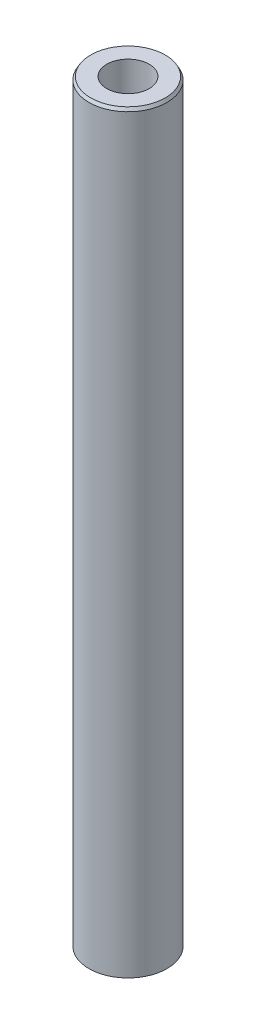
ISO-10303-21;
HEADER;
FILE_DESCRIPTION(('STEP AP214'),'2;1');
FILE_NAME('part.step','',(''),(''),'','','');
FILE_SCHEMA(('AUTOMOTIVE_DESIGN { 1 0 10303 214 1 1 1 1 }'));
ENDSEC;
DATA;
#1=APPLICATION_CONTEXT('core data for automotive mechanical design processes');
#2=APPLICATION_PROTOCOL_DEFINITION('international standard','automotive_design',2000,#1);
#3=PRODUCT_CONTEXT('',#1,'mechanical');
#4=PRODUCT('Part','Part','',(#3));
#5=PRODUCT_RELATED_PRODUCT_CATEGORY('part','',(#4));
#6=PRODUCT_DEFINITION_FORMATION('','',#4);
#7=PRODUCT_DEFINITION_CONTEXT('part definition',#1,'design');
#8=PRODUCT_DEFINITION('design','',#6,#7);
#9=PRODUCT_DEFINITION_SHAPE('','',#8);
#10=(LENGTH_UNIT() NAMED_UNIT(*) SI_UNIT(.MILLI.,.METRE.));
#11=(NAMED_UNIT(*) PLANE_ANGLE_UNIT() SI_UNIT($,.RADIAN.));
#12=(NAMED_UNIT(*) SI_UNIT($,.STERADIAN.) SOLID_ANGLE_UNIT());
#13=UNCERTAINTY_MEASURE_WITH_UNIT(LENGTH_MEASURE(1.E-05),#10,'distance_accuracy_value','');
#14=(GEOMETRIC_REPRESENTATION_CONTEXT(3) GLOBAL_UNCERTAINTY_ASSIGNED_CONTEXT((#13)) GLOBAL_UNIT_ASSIGNED_CONTEXT((#10,
#11,#12)) REPRESENTATION_CONTEXT('',''));
#15=CARTESIAN_POINT('',(0.,0.,0.));
#16=DIRECTION('',(0.,0.,1.));
#17=DIRECTION('',(1.,0.,0.));
#18=AXIS2_PLACEMENT_3D('',#15,#16,#17);
#19=CARTESIAN_POINT('',(0.,241.917062888604,0.));
#20=DIRECTION('',(0.,-1.,0.));
#21=DIRECTION('',(0.,0.,-1.));
#22=AXIS2_PLACEMENT_3D('',#19,#20,#21);
#23=CYLINDRICAL_SURFACE('',#22,12.5);
#24=CARTESIAN_POINT('',(0.,240.937329689685,0.));
#25=DIRECTION('',(0.,1.,0.));
#26=DIRECTION('',(0.,0.,1.));
#27=AXIS2_PLACEMENT_3D('',#24,#25,#26);
#28=CIRCLE('',#27,12.5);
#29=CARTESIAN_POINT('',(0.,240.937329689685,12.5));
#30=VERTEX_POINT('',#29);
#31=EDGE_CURVE('E50',#30,#30,#28,.F.);
#32=ORIENTED_EDGE('',*,*,#31,.T.);
#33=EDGE_LOOP('',(#32));
#34=FACE_BOUND('',#33,.T.);
#35=CARTESIAN_POINT('',(0.,0.565649226129838,0.));
#36=DIRECTION('',(0.,1.,0.));
#37=DIRECTION('',(0.,0.,1.));
#38=AXIS2_PLACEMENT_3D('',#35,#36,#37);
#39=CIRCLE('',#38,12.5);
#40=CARTESIAN_POINT('',(0.,0.565649226129838,12.5));
#41=VERTEX_POINT('',#40);
#42=EDGE_CURVE('E51',#41,#41,#39,.T.);
#43=ORIENTED_EDGE('',*,*,#42,.T.);
#44=EDGE_LOOP('',(#43));
#45=FACE_BOUND('',#44,.T.);
#46=ADVANCED_FACE('F39',(#34,#45),#23,.T.);
#47=CARTESIAN_POINT('',(0.,241.917062888604,0.));
#48=DIRECTION('',(0.,1.,0.));
#49=DIRECTION('',(0.,0.,1.));
#50=AXIS2_PLACEMENT_3D('',#47,#48,#49);
#51=PLANE('',#50);
#52=CARTESIAN_POINT('',(0.,241.917062888604,0.));
#53=DIRECTION('',(0.,1.,0.));
#54=DIRECTION('',(0.,0.,1.));
#55=AXIS2_PLACEMENT_3D('',#52,#53,#54);
#56=CIRCLE('',#55,11.9343507738702);
#57=CARTESIAN_POINT('',(0.,241.917062888604,11.9343507738702));
#58=VERTEX_POINT('',#57);
#59=EDGE_CURVE('E54',#58,#58,#56,.T.);
#60=ORIENTED_EDGE('',*,*,#59,.T.);
#61=EDGE_LOOP('',(#60));
#62=FACE_BOUND('',#61,.T.);
#63=CARTESIAN_POINT('',(0.,241.917062888604,0.));
#64=DIRECTION('',(0.,1.,0.));
#65=DIRECTION('',(0.,0.,1.));
#66=AXIS2_PLACEMENT_3D('',#63,#64,#65);
#67=CIRCLE('',#66,6.79041014084931);
#68=CARTESIAN_POINT('',(0.,241.917062888604,6.79041014084931));
#69=VERTEX_POINT('',#68);
#70=EDGE_CURVE('E58',#69,#69,#67,.T.);
#71=ORIENTED_EDGE('',*,*,#70,.F.);
#72=EDGE_LOOP('',(#71));
#73=FACE_BOUND('',#72,.T.);
#74=ADVANCED_FACE('F69',(#62,#73),#51,.T.);
#75=CARTESIAN_POINT('',(0.,0.,0.));
#76=DIRECTION('',(0.,1.,0.));
#77=DIRECTION('',(0.,0.,1.));
#78=AXIS2_PLACEMENT_3D('',#75,#76,#77);
#79=PLANE('',#78);
#80=CARTESIAN_POINT('',(0.,0.,0.));
#81=DIRECTION('',(0.,1.,0.));
#82=DIRECTION('',(0.,0.,1.));
#83=AXIS2_PLACEMENT_3D('',#80,#81,#82);
#84=CIRCLE('',#83,11.5202668010811);
#85=CARTESIAN_POINT('',(0.,0.,11.5202668010811));
#86=VERTEX_POINT('',#85);
#87=EDGE_CURVE('E10',#86,#86,#84,.F.);
#88=ORIENTED_EDGE('',*,*,#87,.T.);
#89=EDGE_LOOP('',(#88));
#90=FACE_BOUND('',#89,.T.);
#91=CARTESIAN_POINT('',(0.,0.,0.));
#92=DIRECTION('',(0.,1.,0.));
#93=DIRECTION('',(0.,0.,1.));
#94=AXIS2_PLACEMENT_3D('',#91,#92,#93);
#95=CIRCLE('',#94,6.79041014084931);
#96=CARTESIAN_POINT('',(0.,0.,6.79041014084931));
#97=VERTEX_POINT('',#96);
#98=EDGE_CURVE('E63',#97,#97,#95,.T.);
#99=ORIENTED_EDGE('',*,*,#98,.T.);
#100=EDGE_LOOP('',(#99));
#101=FACE_BOUND('',#100,.T.);
#102=ADVANCED_FACE('F75',(#90,#101),#79,.F.);
#103=CARTESIAN_POINT('',(0.,241.917062888604,0.));
#104=DIRECTION('',(0.,-1.,0.));
#105=DIRECTION('',(0.,0.,-1.));
#106=AXIS2_PLACEMENT_3D('',#103,#104,#105);
#107=CYLINDRICAL_SURFACE('',#106,6.79041014084931);
#108=ORIENTED_EDGE('',*,*,#70,.T.);
#109=EDGE_LOOP('',(#108));
#110=FACE_BOUND('',#109,.T.);
#111=ORIENTED_EDGE('',*,*,#98,.F.);
#112=EDGE_LOOP('',(#111));
#113=FACE_BOUND('',#112,.T.);
#114=ADVANCED_FACE('F70',(#110,#113),#107,.F.);
#115=CARTESIAN_POINT('',(0.,241.917062888604,0.));
#116=DIRECTION('',(0.,-1.,0.));
#117=DIRECTION('',(0.,0.,-1.));
#118=AXIS2_PLACEMENT_3D('',#115,#116,#117);
#119=CONICAL_SURFACE('',#118,11.9343507738702,0.523598775598293);
#120=ORIENTED_EDGE('',*,*,#31,.F.);
#121=EDGE_LOOP('',(#120));
#122=FACE_BOUND('',#121,.T.);
#123=ORIENTED_EDGE('',*,*,#59,.F.);
#124=EDGE_LOOP('',(#123));
#125=FACE_BOUND('',#124,.T.);
#126=ADVANCED_FACE('F81',(#122,#125),#119,.T.);
#127=CARTESIAN_POINT('',(0.,0.565649226129838,0.));
#128=DIRECTION('',(0.,1.,0.));
#129=DIRECTION('',(0.,0.,1.));
#130=AXIS2_PLACEMENT_3D('',#127,#128,#129);
#131=CONICAL_SURFACE('',#130,12.5,1.04719755119659);
#132=ORIENTED_EDGE('',*,*,#87,.F.);
#133=EDGE_LOOP('',(#132));
#134=FACE_BOUND('',#133,.T.);
#135=ORIENTED_EDGE('',*,*,#42,.F.);
#136=EDGE_LOOP('',(#135));
#137=FACE_BOUND('',#136,.T.);
#138=ADVANCED_FACE('F45',(#134,#137),#131,.T.);
#139=CLOSED_SHELL('',(#46,#74,#102,#114,#126,#138));
#140=MANIFOLD_SOLID_BREP('B2',#139);
#141=ADVANCED_BREP_SHAPE_REPRESENTATION('',(#18,#140),#14);
#142=SHAPE_DEFINITION_REPRESENTATION(#9,#141);
ENDSEC;
END-ISO-10303-21;
